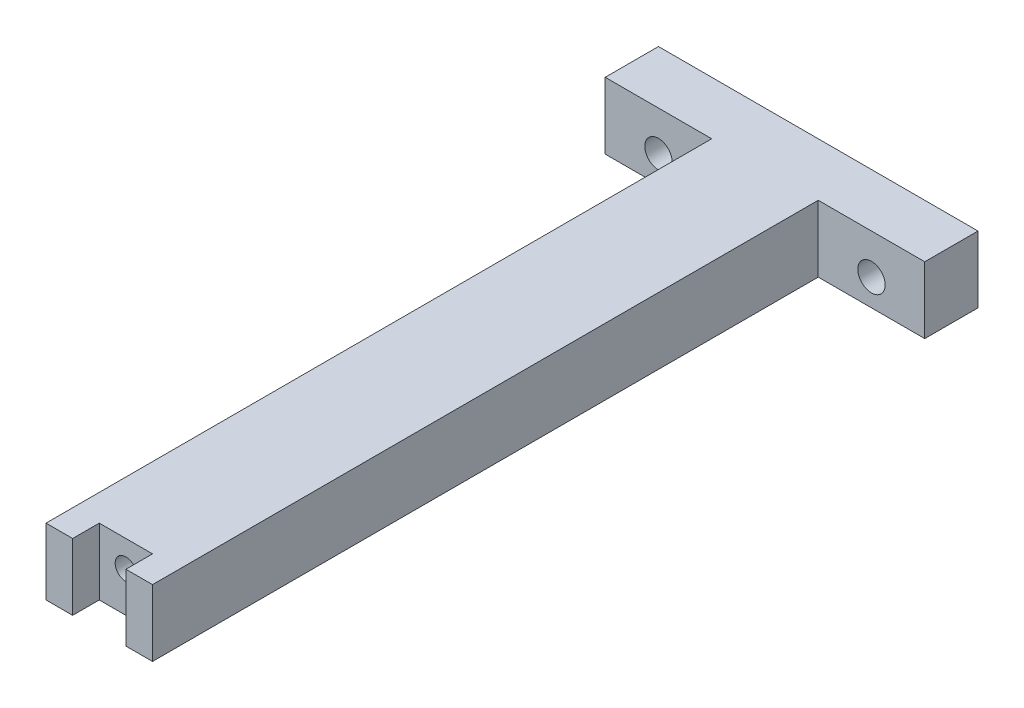
ISO-10303-21;
HEADER;
FILE_DESCRIPTION(('STEP AP214'),'2;1');
FILE_NAME('part.step','',(''),(''),'','','');
FILE_SCHEMA(('AUTOMOTIVE_DESIGN { 1 0 10303 214 1 1 1 1 }'));
ENDSEC;
DATA;
#1=APPLICATION_CONTEXT('core data for automotive mechanical design processes');
#2=APPLICATION_PROTOCOL_DEFINITION('international standard','automotive_design',2000,#1);
#3=PRODUCT_CONTEXT('',#1,'mechanical');
#4=PRODUCT('Part','Part','',(#3));
#5=PRODUCT_RELATED_PRODUCT_CATEGORY('part','',(#4));
#6=PRODUCT_DEFINITION_FORMATION('','',#4);
#7=PRODUCT_DEFINITION_CONTEXT('part definition',#1,'design');
#8=PRODUCT_DEFINITION('design','',#6,#7);
#9=PRODUCT_DEFINITION_SHAPE('','',#8);
#10=(LENGTH_UNIT() NAMED_UNIT(*) SI_UNIT(.MILLI.,.METRE.));
#11=(NAMED_UNIT(*) PLANE_ANGLE_UNIT() SI_UNIT($,.RADIAN.));
#12=(NAMED_UNIT(*) SI_UNIT($,.STERADIAN.) SOLID_ANGLE_UNIT());
#13=UNCERTAINTY_MEASURE_WITH_UNIT(LENGTH_MEASURE(1.E-05),#10,'distance_accuracy_value','');
#14=(GEOMETRIC_REPRESENTATION_CONTEXT(3) GLOBAL_UNCERTAINTY_ASSIGNED_CONTEXT((#13)) GLOBAL_UNIT_ASSIGNED_CONTEXT((#10,
#11,#12)) REPRESENTATION_CONTEXT('',''));
#15=CARTESIAN_POINT('',(0.,0.,0.));
#16=DIRECTION('',(0.,0.,1.));
#17=DIRECTION('',(1.,0.,0.));
#18=AXIS2_PLACEMENT_3D('',#15,#16,#17);
#19=CARTESIAN_POINT('',(0.,0.,171.45));
#20=DIRECTION('',(0.,0.,-1.));
#21=DIRECTION('',(-1.,0.,0.));
#22=AXIS2_PLACEMENT_3D('',#19,#20,#21);
#23=PLANE('',#22);
#24=DIRECTION('',(-1.,0.,0.));
#25=VECTOR('',#24,1.);
#26=CARTESIAN_POINT('',(-38.1,7.9375,171.45));
#27=LINE('',#26,#25);
#28=CARTESIAN_POINT('',(12.7,7.9375,171.45));
#29=VERTEX_POINT('',#28);
#30=CARTESIAN_POINT('',(6.35,7.9375,171.45));
#31=VERTEX_POINT('',#30);
#32=EDGE_CURVE('E206',#29,#31,#27,.T.);
#33=ORIENTED_EDGE('',*,*,#32,.T.);
#34=DIRECTION('',(0.,1.,0.));
#35=VECTOR('',#34,1.);
#36=CARTESIAN_POINT('',(6.35,-7.9375,171.45));
#37=LINE('',#36,#35);
#38=CARTESIAN_POINT('',(6.35,-7.9375,171.45));
#39=VERTEX_POINT('',#38);
#40=EDGE_CURVE('E140',#39,#31,#37,.T.);
#41=ORIENTED_EDGE('',*,*,#40,.F.);
#42=DIRECTION('',(1.,0.,0.));
#43=VECTOR('',#42,1.);
#44=CARTESIAN_POINT('',(-38.1,-7.9375,171.45));
#45=LINE('',#44,#43);
#46=CARTESIAN_POINT('',(12.7,-7.9375,171.45));
#47=VERTEX_POINT('',#46);
#48=EDGE_CURVE('E209',#39,#47,#45,.T.);
#49=ORIENTED_EDGE('',*,*,#48,.T.);
#50=DIRECTION('',(0.,-1.,0.));
#51=VECTOR('',#50,1.);
#52=CARTESIAN_POINT('',(12.7,7.9375,171.45));
#53=LINE('',#52,#51);
#54=EDGE_CURVE('E165',#29,#47,#53,.T.);
#55=ORIENTED_EDGE('',*,*,#54,.F.);
#56=EDGE_LOOP('',(#33,#41,#49,#55));
#57=FACE_BOUND('',#56,.T.);
#58=ADVANCED_FACE('F38',(#57),#23,.F.);
#59=CARTESIAN_POINT('',(-38.1,-7.9375,171.45));
#60=DIRECTION('',(1.,0.,0.));
#61=DIRECTION('',(0.,0.,-1.));
#62=AXIS2_PLACEMENT_3D('',#59,#60,#61);
#63=PLANE('',#62);
#64=DIRECTION('',(0.,-1.,0.));
#65=VECTOR('',#64,1.);
#66=CARTESIAN_POINT('',(-38.1,7.9375,12.7));
#67=LINE('',#66,#65);
#68=CARTESIAN_POINT('',(-38.1,7.9375,12.7));
#69=VERTEX_POINT('',#68);
#70=CARTESIAN_POINT('',(-38.1,-7.9375,12.7));
#71=VERTEX_POINT('',#70);
#72=EDGE_CURVE('E172',#69,#71,#67,.T.);
#73=ORIENTED_EDGE('',*,*,#72,.F.);
#74=DIRECTION('',(0.,0.,-1.));
#75=VECTOR('',#74,1.);
#76=CARTESIAN_POINT('',(-38.1,7.9375,171.45));
#77=LINE('',#76,#75);
#78=CARTESIAN_POINT('',(-38.1,7.9375,0.));
#79=VERTEX_POINT('',#78);
#80=EDGE_CURVE('E47',#69,#79,#77,.T.);
#81=ORIENTED_EDGE('',*,*,#80,.T.);
#82=DIRECTION('',(0.,-1.,0.));
#83=VECTOR('',#82,1.);
#84=CARTESIAN_POINT('',(-38.1,-7.9375,0.));
#85=LINE('',#84,#83);
#86=CARTESIAN_POINT('',(-38.1,-7.9375,0.));
#87=VERTEX_POINT('',#86);
#88=EDGE_CURVE('E220',#79,#87,#85,.T.);
#89=ORIENTED_EDGE('',*,*,#88,.T.);
#90=DIRECTION('',(0.,0.,-1.));
#91=VECTOR('',#90,1.);
#92=CARTESIAN_POINT('',(-38.1,-7.9375,171.45));
#93=LINE('',#92,#91);
#94=EDGE_CURVE('E227',#71,#87,#93,.T.);
#95=ORIENTED_EDGE('',*,*,#94,.F.);
#96=EDGE_LOOP('',(#73,#81,#89,#95));
#97=FACE_BOUND('',#96,.T.);
#98=ADVANCED_FACE('F278',(#97),#63,.F.);
#99=CARTESIAN_POINT('',(38.1,-7.9375,171.45));
#100=DIRECTION('',(-1.,0.,0.));
#101=DIRECTION('',(0.,0.,1.));
#102=AXIS2_PLACEMENT_3D('',#99,#100,#101);
#103=PLANE('',#102);
#104=DIRECTION('',(0.,0.,-1.));
#105=VECTOR('',#104,1.);
#106=CARTESIAN_POINT('',(38.1,7.9375,171.45));
#107=LINE('',#106,#105);
#108=CARTESIAN_POINT('',(38.1,7.9375,12.7));
#109=VERTEX_POINT('',#108);
#110=CARTESIAN_POINT('',(38.1,7.9375,0.));
#111=VERTEX_POINT('',#110);
#112=EDGE_CURVE('E11',#109,#111,#107,.T.);
#113=ORIENTED_EDGE('',*,*,#112,.F.);
#114=DIRECTION('',(0.,1.,0.));
#115=VECTOR('',#114,1.);
#116=CARTESIAN_POINT('',(38.1,7.9375,12.7));
#117=LINE('',#116,#115);
#118=CARTESIAN_POINT('',(38.1,-7.9375,12.7));
#119=VERTEX_POINT('',#118);
#120=EDGE_CURVE('E190',#119,#109,#117,.T.);
#121=ORIENTED_EDGE('',*,*,#120,.F.);
#122=DIRECTION('',(0.,0.,-1.));
#123=VECTOR('',#122,1.);
#124=CARTESIAN_POINT('',(38.1,-7.9375,171.45));
#125=LINE('',#124,#123);
#126=CARTESIAN_POINT('',(38.1,-7.9375,0.));
#127=VERTEX_POINT('',#126);
#128=EDGE_CURVE('E214',#119,#127,#125,.T.);
#129=ORIENTED_EDGE('',*,*,#128,.T.);
#130=DIRECTION('',(0.,1.,0.));
#131=VECTOR('',#130,1.);
#132=CARTESIAN_POINT('',(38.1,-7.9375,0.));
#133=LINE('',#132,#131);
#134=EDGE_CURVE('E188',#127,#111,#133,.T.);
#135=ORIENTED_EDGE('',*,*,#134,.T.);
#136=EDGE_LOOP('',(#113,#121,#129,#135));
#137=FACE_BOUND('',#136,.T.);
#138=ADVANCED_FACE('F40',(#137),#103,.F.);
#139=CARTESIAN_POINT('',(-38.1,7.9375,171.45));
#140=DIRECTION('',(0.,-1.,0.));
#141=DIRECTION('',(0.,0.,-1.));
#142=AXIS2_PLACEMENT_3D('',#139,#140,#141);
#143=PLANE('',#142);
#144=DIRECTION('',(-1.,0.,0.));
#145=VECTOR('',#144,1.);
#146=CARTESIAN_POINT('',(-6.35,7.9375,165.1));
#147=LINE('',#146,#145);
#148=CARTESIAN_POINT('',(6.35,7.9375,165.1));
#149=VERTEX_POINT('',#148);
#150=CARTESIAN_POINT('',(-6.35,7.9375,165.1));
#151=VERTEX_POINT('',#150);
#152=EDGE_CURVE('E152',#149,#151,#147,.T.);
#153=ORIENTED_EDGE('',*,*,#152,.F.);
#154=DIRECTION('',(0.,0.,1.));
#155=VECTOR('',#154,1.);
#156=CARTESIAN_POINT('',(6.35,7.9375,165.1));
#157=LINE('',#156,#155);
#158=EDGE_CURVE('E160',#149,#31,#157,.T.);
#159=ORIENTED_EDGE('',*,*,#158,.T.);
#160=ORIENTED_EDGE('',*,*,#32,.F.);
#161=DIRECTION('',(0.,0.,1.));
#162=VECTOR('',#161,1.);
#163=CARTESIAN_POINT('',(12.7,7.9375,12.7));
#164=LINE('',#163,#162);
#165=CARTESIAN_POINT('',(12.7,7.9375,12.7));
#166=VERTEX_POINT('',#165);
#167=EDGE_CURVE('E200',#166,#29,#164,.T.);
#168=ORIENTED_EDGE('',*,*,#167,.F.);
#169=DIRECTION('',(-1.,0.,0.));
#170=VECTOR('',#169,1.);
#171=CARTESIAN_POINT('',(38.1,7.9375,12.7));
#172=LINE('',#171,#170);
#173=EDGE_CURVE('E192',#109,#166,#172,.T.);
#174=ORIENTED_EDGE('',*,*,#173,.F.);
#175=ORIENTED_EDGE('',*,*,#112,.T.);
#176=DIRECTION('',(-1.,0.,0.));
#177=VECTOR('',#176,1.);
#178=CARTESIAN_POINT('',(-38.1,7.9375,0.));
#179=LINE('',#178,#177);
#180=EDGE_CURVE('E217',#111,#79,#179,.T.);
#181=ORIENTED_EDGE('',*,*,#180,.T.);
#182=ORIENTED_EDGE('',*,*,#80,.F.);
#183=DIRECTION('',(-1.,0.,0.));
#184=VECTOR('',#183,1.);
#185=CARTESIAN_POINT('',(-38.1,7.9375,12.7));
#186=LINE('',#185,#184);
#187=CARTESIAN_POINT('',(-12.7,7.9375,12.7));
#188=VERTEX_POINT('',#187);
#189=EDGE_CURVE('E181',#188,#69,#186,.T.);
#190=ORIENTED_EDGE('',*,*,#189,.F.);
#191=DIRECTION('',(0.,0.,1.));
#192=VECTOR('',#191,1.);
#193=CARTESIAN_POINT('',(-12.7,7.9375,12.7));
#194=LINE('',#193,#192);
#195=CARTESIAN_POINT('',(-12.7,7.9375,171.45));
#196=VERTEX_POINT('',#195);
#197=EDGE_CURVE('E185',#188,#196,#194,.T.);
#198=ORIENTED_EDGE('',*,*,#197,.T.);
#199=CARTESIAN_POINT('',(-6.35000000000001,7.9375,171.45));
#200=VERTEX_POINT('',#199);
#201=EDGE_CURVE('E210',#200,#196,#27,.T.);
#202=ORIENTED_EDGE('',*,*,#201,.F.);
#203=DIRECTION('',(0.,0.,1.));
#204=VECTOR('',#203,1.);
#205=CARTESIAN_POINT('',(-6.35,7.9375,165.1));
#206=LINE('',#205,#204);
#207=EDGE_CURVE('E55',#151,#200,#206,.T.);
#208=ORIENTED_EDGE('',*,*,#207,.F.);
#209=EDGE_LOOP('',(#153,#159,#160,#168,#174,#175,#181,#182,#190,#198,#202,#208));
#210=FACE_BOUND('',#209,.T.);
#211=ADVANCED_FACE('F268',(#210),#143,.F.);
#212=CARTESIAN_POINT('',(-38.1,-7.9375,171.45));
#213=DIRECTION('',(0.,1.,0.));
#214=DIRECTION('',(0.,0.,1.));
#215=AXIS2_PLACEMENT_3D('',#212,#213,#214);
#216=PLANE('',#215);
#217=ORIENTED_EDGE('',*,*,#48,.F.);
#218=DIRECTION('',(0.,0.,1.));
#219=VECTOR('',#218,1.);
#220=CARTESIAN_POINT('',(6.35,-7.9375,165.1));
#221=LINE('',#220,#219);
#222=CARTESIAN_POINT('',(6.35,-7.9375,165.1));
#223=VERTEX_POINT('',#222);
#224=EDGE_CURVE('E163',#223,#39,#221,.T.);
#225=ORIENTED_EDGE('',*,*,#224,.F.);
#226=DIRECTION('',(1.,0.,0.));
#227=VECTOR('',#226,1.);
#228=CARTESIAN_POINT('',(-6.35,-7.9375,165.1));
#229=LINE('',#228,#227);
#230=CARTESIAN_POINT('',(-6.35,-7.9375,165.1));
#231=VERTEX_POINT('',#230);
#232=EDGE_CURVE('E158',#231,#223,#229,.T.);
#233=ORIENTED_EDGE('',*,*,#232,.F.);
#234=DIRECTION('',(0.,0.,1.));
#235=VECTOR('',#234,1.);
#236=CARTESIAN_POINT('',(-6.35,-7.9375,165.1));
#237=LINE('',#236,#235);
#238=CARTESIAN_POINT('',(-6.35,-7.9375,171.45));
#239=VERTEX_POINT('',#238);
#240=EDGE_CURVE('E166',#231,#239,#237,.T.);
#241=ORIENTED_EDGE('',*,*,#240,.T.);
#242=CARTESIAN_POINT('',(-12.7,-7.9375,171.45));
#243=VERTEX_POINT('',#242);
#244=EDGE_CURVE('E211',#243,#239,#45,.T.);
#245=ORIENTED_EDGE('',*,*,#244,.F.);
#246=DIRECTION('',(0.,0.,1.));
#247=VECTOR('',#246,1.);
#248=CARTESIAN_POINT('',(-12.7,-7.9375,12.7));
#249=LINE('',#248,#247);
#250=CARTESIAN_POINT('',(-12.7,-7.9375,12.7));
#251=VERTEX_POINT('',#250);
#252=EDGE_CURVE('E63',#251,#243,#249,.T.);
#253=ORIENTED_EDGE('',*,*,#252,.F.);
#254=DIRECTION('',(1.,0.,0.));
#255=VECTOR('',#254,1.);
#256=CARTESIAN_POINT('',(-38.1,-7.9375,12.7));
#257=LINE('',#256,#255);
#258=EDGE_CURVE('E174',#71,#251,#257,.T.);
#259=ORIENTED_EDGE('',*,*,#258,.F.);
#260=ORIENTED_EDGE('',*,*,#94,.T.);
#261=DIRECTION('',(1.,0.,0.));
#262=VECTOR('',#261,1.);
#263=CARTESIAN_POINT('',(-38.1,-7.9375,0.));
#264=LINE('',#263,#262);
#265=EDGE_CURVE('E223',#87,#127,#264,.T.);
#266=ORIENTED_EDGE('',*,*,#265,.T.);
#267=ORIENTED_EDGE('',*,*,#128,.F.);
#268=DIRECTION('',(1.,0.,0.));
#269=VECTOR('',#268,1.);
#270=CARTESIAN_POINT('',(38.1,-7.9375,12.7));
#271=LINE('',#270,#269);
#272=CARTESIAN_POINT('',(12.7,-7.9375,12.7));
#273=VERTEX_POINT('',#272);
#274=EDGE_CURVE('E198',#273,#119,#271,.T.);
#275=ORIENTED_EDGE('',*,*,#274,.F.);
#276=DIRECTION('',(0.,0.,1.));
#277=VECTOR('',#276,1.);
#278=CARTESIAN_POINT('',(12.7,-7.9375,12.7));
#279=LINE('',#278,#277);
#280=EDGE_CURVE('E184',#273,#47,#279,.T.);
#281=ORIENTED_EDGE('',*,*,#280,.T.);
#282=EDGE_LOOP('',(#217,#225,#233,#241,#245,#253,#259,#260,#266,#267,#275,#281));
#283=FACE_BOUND('',#282,.T.);
#284=ADVANCED_FACE('F285',(#283),#216,.F.);
#285=ORIENTED_EDGE('',*,*,#244,.T.);
#286=DIRECTION('',(0.,-1.,0.));
#287=VECTOR('',#286,1.);
#288=CARTESIAN_POINT('',(-6.35,-7.9375,171.45));
#289=LINE('',#288,#287);
#290=EDGE_CURVE('E143',#200,#239,#289,.T.);
#291=ORIENTED_EDGE('',*,*,#290,.F.);
#292=ORIENTED_EDGE('',*,*,#201,.T.);
#293=DIRECTION('',(0.,1.,0.));
#294=VECTOR('',#293,1.);
#295=CARTESIAN_POINT('',(-12.7,7.9375,171.45));
#296=LINE('',#295,#294);
#297=EDGE_CURVE('E175',#243,#196,#296,.T.);
#298=ORIENTED_EDGE('',*,*,#297,.F.);
#299=EDGE_LOOP('',(#285,#291,#292,#298));
#300=FACE_BOUND('',#299,.T.);
#301=ADVANCED_FACE('F289',(#300),#23,.F.);
#302=CARTESIAN_POINT('',(0.,0.,0.));
#303=DIRECTION('',(0.,0.,-1.));
#304=DIRECTION('',(-1.,0.,0.));
#305=AXIS2_PLACEMENT_3D('',#302,#303,#304);
#306=PLANE('',#305);
#307=CARTESIAN_POINT('',(-25.4,-1.5875,0.));
#308=DIRECTION('',(0.,0.,1.));
#309=DIRECTION('',(1.,0.,0.));
#310=AXIS2_PLACEMENT_3D('',#307,#308,#309);
#311=CIRCLE('',#310,3.2639);
#312=CARTESIAN_POINT('',(-22.1361,-1.5875,0.));
#313=VERTEX_POINT('',#312);
#314=EDGE_CURVE('E231',#313,#313,#311,.T.);
#315=ORIENTED_EDGE('',*,*,#314,.T.);
#316=EDGE_LOOP('',(#315));
#317=FACE_BOUND('',#316,.T.);
#318=CARTESIAN_POINT('',(25.4,-1.5875,0.));
#319=DIRECTION('',(0.,0.,1.));
#320=DIRECTION('',(1.,0.,0.));
#321=AXIS2_PLACEMENT_3D('',#318,#319,#320);
#322=CIRCLE('',#321,3.2639);
#323=CARTESIAN_POINT('',(28.6639,-1.5875,0.));
#324=VERTEX_POINT('',#323);
#325=EDGE_CURVE('E236',#324,#324,#322,.T.);
#326=ORIENTED_EDGE('',*,*,#325,.T.);
#327=EDGE_LOOP('',(#326));
#328=FACE_BOUND('',#327,.T.);
#329=ORIENTED_EDGE('',*,*,#134,.F.);
#330=ORIENTED_EDGE('',*,*,#265,.F.);
#331=ORIENTED_EDGE('',*,*,#88,.F.);
#332=ORIENTED_EDGE('',*,*,#180,.F.);
#333=EDGE_LOOP('',(#329,#330,#331,#332));
#334=FACE_BOUND('',#333,.T.);
#335=ADVANCED_FACE('F243',(#317,#328,#334),#306,.T.);
#336=CARTESIAN_POINT('',(12.7,7.9375,12.7));
#337=DIRECTION('',(-1.,0.,0.));
#338=DIRECTION('',(0.,-1.,0.));
#339=AXIS2_PLACEMENT_3D('',#336,#337,#338);
#340=PLANE('',#339);
#341=ORIENTED_EDGE('',*,*,#54,.T.);
#342=ORIENTED_EDGE('',*,*,#280,.F.);
#343=DIRECTION('',(0.,-1.,0.));
#344=VECTOR('',#343,1.);
#345=CARTESIAN_POINT('',(12.7,7.9375,12.7));
#346=LINE('',#345,#344);
#347=EDGE_CURVE('E195',#166,#273,#346,.T.);
#348=ORIENTED_EDGE('',*,*,#347,.F.);
#349=ORIENTED_EDGE('',*,*,#167,.T.);
#350=EDGE_LOOP('',(#341,#342,#348,#349));
#351=FACE_BOUND('',#350,.T.);
#352=ADVANCED_FACE('F257',(#351),#340,.F.);
#353=CARTESIAN_POINT('',(0.,0.,12.7));
#354=DIRECTION('',(0.,0.,-1.));
#355=DIRECTION('',(-1.,0.,0.));
#356=AXIS2_PLACEMENT_3D('',#353,#354,#355);
#357=PLANE('',#356);
#358=CARTESIAN_POINT('',(25.4,-1.5875,12.7));
#359=DIRECTION('',(0.,0.,-1.));
#360=DIRECTION('',(-1.,0.,0.));
#361=AXIS2_PLACEMENT_3D('',#358,#359,#360);
#362=CIRCLE('',#361,3.2639);
#363=CARTESIAN_POINT('',(22.1361,-1.5875,12.7));
#364=VERTEX_POINT('',#363);
#365=EDGE_CURVE('E42',#364,#364,#362,.T.);
#366=ORIENTED_EDGE('',*,*,#365,.T.);
#367=EDGE_LOOP('',(#366));
#368=FACE_BOUND('',#367,.T.);
#369=ORIENTED_EDGE('',*,*,#120,.T.);
#370=ORIENTED_EDGE('',*,*,#173,.T.);
#371=ORIENTED_EDGE('',*,*,#347,.T.);
#372=ORIENTED_EDGE('',*,*,#274,.T.);
#373=EDGE_LOOP('',(#369,#370,#371,#372));
#374=FACE_BOUND('',#373,.T.);
#375=ADVANCED_FACE('F253',(#368,#374),#357,.F.);
#376=CARTESIAN_POINT('',(-12.7,7.9375,12.7));
#377=DIRECTION('',(1.,0.,0.));
#378=DIRECTION('',(0.,1.,0.));
#379=AXIS2_PLACEMENT_3D('',#376,#377,#378);
#380=PLANE('',#379);
#381=ORIENTED_EDGE('',*,*,#297,.T.);
#382=ORIENTED_EDGE('',*,*,#197,.F.);
#383=DIRECTION('',(0.,1.,0.));
#384=VECTOR('',#383,1.);
#385=CARTESIAN_POINT('',(-12.7,7.9375,12.7));
#386=LINE('',#385,#384);
#387=EDGE_CURVE('E178',#251,#188,#386,.T.);
#388=ORIENTED_EDGE('',*,*,#387,.F.);
#389=ORIENTED_EDGE('',*,*,#252,.T.);
#390=EDGE_LOOP('',(#381,#382,#388,#389));
#391=FACE_BOUND('',#390,.T.);
#392=ADVANCED_FACE('F256',(#391),#380,.F.);
#393=CARTESIAN_POINT('',(0.,0.,12.7));
#394=DIRECTION('',(0.,0.,1.));
#395=DIRECTION('',(1.,0.,0.));
#396=AXIS2_PLACEMENT_3D('',#393,#394,#395);
#397=PLANE('',#396);
#398=CARTESIAN_POINT('',(-25.4,-1.5875,12.7));
#399=DIRECTION('',(0.,0.,1.));
#400=DIRECTION('',(1.,0.,0.));
#401=AXIS2_PLACEMENT_3D('',#398,#399,#400);
#402=CIRCLE('',#401,3.2639);
#403=CARTESIAN_POINT('',(-22.1361,-1.5875,12.7));
#404=VERTEX_POINT('',#403);
#405=EDGE_CURVE('E229',#404,#404,#402,.T.);
#406=ORIENTED_EDGE('',*,*,#405,.F.);
#407=EDGE_LOOP('',(#406));
#408=FACE_BOUND('',#407,.T.);
#409=ORIENTED_EDGE('',*,*,#72,.T.);
#410=ORIENTED_EDGE('',*,*,#258,.T.);
#411=ORIENTED_EDGE('',*,*,#387,.T.);
#412=ORIENTED_EDGE('',*,*,#189,.T.);
#413=EDGE_LOOP('',(#409,#410,#411,#412));
#414=FACE_BOUND('',#413,.T.);
#415=ADVANCED_FACE('F282',(#408,#414),#397,.T.);
#416=CARTESIAN_POINT('',(6.35,-7.9375,165.1));
#417=DIRECTION('',(1.,0.,0.));
#418=DIRECTION('',(0.,0.,-1.));
#419=AXIS2_PLACEMENT_3D('',#416,#417,#418);
#420=PLANE('',#419);
#421=ORIENTED_EDGE('',*,*,#40,.T.);
#422=ORIENTED_EDGE('',*,*,#158,.F.);
#423=DIRECTION('',(0.,1.,0.));
#424=VECTOR('',#423,1.);
#425=CARTESIAN_POINT('',(6.35,-7.9375,165.1));
#426=LINE('',#425,#424);
#427=EDGE_CURVE('E149',#223,#149,#426,.T.);
#428=ORIENTED_EDGE('',*,*,#427,.F.);
#429=ORIENTED_EDGE('',*,*,#224,.T.);
#430=EDGE_LOOP('',(#421,#422,#428,#429));
#431=FACE_BOUND('',#430,.T.);
#432=ADVANCED_FACE('F294',(#431),#420,.F.);
#433=CARTESIAN_POINT('',(-6.35,-7.9375,165.1));
#434=DIRECTION('',(-1.,0.,0.));
#435=DIRECTION('',(0.,0.,1.));
#436=AXIS2_PLACEMENT_3D('',#433,#434,#435);
#437=PLANE('',#436);
#438=ORIENTED_EDGE('',*,*,#290,.T.);
#439=ORIENTED_EDGE('',*,*,#240,.F.);
#440=DIRECTION('',(0.,-1.,0.));
#441=VECTOR('',#440,1.);
#442=CARTESIAN_POINT('',(-6.35,-7.9375,165.1));
#443=LINE('',#442,#441);
#444=EDGE_CURVE('E155',#151,#231,#443,.T.);
#445=ORIENTED_EDGE('',*,*,#444,.F.);
#446=ORIENTED_EDGE('',*,*,#207,.T.);
#447=EDGE_LOOP('',(#438,#439,#445,#446));
#448=FACE_BOUND('',#447,.T.);
#449=ADVANCED_FACE('F372',(#448),#437,.F.);
#450=CARTESIAN_POINT('',(0.,0.,165.1));
#451=DIRECTION('',(0.,0.,-1.));
#452=DIRECTION('',(-1.,0.,0.));
#453=AXIS2_PLACEMENT_3D('',#450,#451,#452);
#454=PLANE('',#453);
#455=CARTESIAN_POINT('',(0.,1.5875,165.1));
#456=DIRECTION('',(0.,0.,1.));
#457=DIRECTION('',(1.,0.,0.));
#458=AXIS2_PLACEMENT_3D('',#455,#456,#457);
#459=CIRCLE('',#458,2.55269999999999);
#460=CARTESIAN_POINT('',(2.55269999999999,1.5875,165.1));
#461=VERTEX_POINT('',#460);
#462=EDGE_CURVE('E141',#461,#461,#459,.T.);
#463=ORIENTED_EDGE('',*,*,#462,.F.);
#464=EDGE_LOOP('',(#463));
#465=FACE_BOUND('',#464,.T.);
#466=ORIENTED_EDGE('',*,*,#427,.T.);
#467=ORIENTED_EDGE('',*,*,#152,.T.);
#468=ORIENTED_EDGE('',*,*,#444,.T.);
#469=ORIENTED_EDGE('',*,*,#232,.T.);
#470=EDGE_LOOP('',(#466,#467,#468,#469));
#471=FACE_BOUND('',#470,.T.);
#472=ADVANCED_FACE('F134',(#465,#471),#454,.F.);
#473=CARTESIAN_POINT('',(0.,1.5875,154.2796));
#474=DIRECTION('',(0.,0.,1.));
#475=DIRECTION('',(1.,0.,0.));
#476=AXIS2_PLACEMENT_3D('',#473,#474,#475);
#477=CONICAL_SURFACE('',#476,2.55269999999999,1.02974425867665);
#478=CARTESIAN_POINT('',(0.,1.5875,152.745783097808));
#479=VERTEX_POINT('',#478);
#480=VERTEX_LOOP('',#479);
#481=FACE_BOUND('',#480,.T.);
#482=CARTESIAN_POINT('',(0.,1.5875,154.2796));
#483=DIRECTION('',(0.,0.,1.));
#484=DIRECTION('',(1.,0.,0.));
#485=AXIS2_PLACEMENT_3D('',#482,#483,#484);
#486=CIRCLE('',#485,2.55269999999999);
#487=CARTESIAN_POINT('',(2.55269999999999,1.5875,154.2796));
#488=VERTEX_POINT('',#487);
#489=EDGE_CURVE('E138',#488,#488,#486,.T.);
#490=ORIENTED_EDGE('',*,*,#489,.T.);
#491=EDGE_LOOP('',(#490));
#492=FACE_BOUND('',#491,.T.);
#493=ADVANCED_FACE('F130',(#481,#492),#477,.F.);
#494=CARTESIAN_POINT('',(0.,1.5875,165.1));
#495=DIRECTION('',(0.,0.,1.));
#496=DIRECTION('',(1.,0.,0.));
#497=AXIS2_PLACEMENT_3D('',#494,#495,#496);
#498=CYLINDRICAL_SURFACE('',#497,2.55269999999999);
#499=ORIENTED_EDGE('',*,*,#489,.F.);
#500=EDGE_LOOP('',(#499));
#501=FACE_BOUND('',#500,.T.);
#502=ORIENTED_EDGE('',*,*,#462,.T.);
#503=EDGE_LOOP('',(#502));
#504=FACE_BOUND('',#503,.T.);
#505=ADVANCED_FACE('F133',(#501,#504),#498,.F.);
#506=CARTESIAN_POINT('',(-25.4,-1.5875,0.));
#507=DIRECTION('',(0.,0.,1.));
#508=DIRECTION('',(1.,0.,0.));
#509=AXIS2_PLACEMENT_3D('',#506,#507,#508);
#510=CYLINDRICAL_SURFACE('',#509,3.2639);
#511=ORIENTED_EDGE('',*,*,#405,.T.);
#512=EDGE_LOOP('',(#511));
#513=FACE_BOUND('',#512,.T.);
#514=ORIENTED_EDGE('',*,*,#314,.F.);
#515=EDGE_LOOP('',(#514));
#516=FACE_BOUND('',#515,.T.);
#517=ADVANCED_FACE('F249',(#513,#516),#510,.F.);
#518=CARTESIAN_POINT('',(25.4,-1.5875,0.));
#519=DIRECTION('',(0.,0.,1.));
#520=DIRECTION('',(1.,0.,0.));
#521=AXIS2_PLACEMENT_3D('',#518,#519,#520);
#522=CYLINDRICAL_SURFACE('',#521,3.2639);
#523=ORIENTED_EDGE('',*,*,#325,.F.);
#524=EDGE_LOOP('',(#523));
#525=FACE_BOUND('',#524,.T.);
#526=ORIENTED_EDGE('',*,*,#365,.F.);
#527=EDGE_LOOP('',(#526));
#528=FACE_BOUND('',#527,.T.);
#529=ADVANCED_FACE('F246',(#525,#528),#522,.F.);
#530=CLOSED_SHELL('',(#58,#98,#138,#211,#284,#301,#335,#352,#375,#392,#415,#432,#449,#472,#493,
#505,#517,#529));
#531=MANIFOLD_SOLID_BREP('B2',#530);
#532=ADVANCED_BREP_SHAPE_REPRESENTATION('',(#18,#531),#14);
#533=SHAPE_DEFINITION_REPRESENTATION(#9,#532);
ENDSEC;
END-ISO-10303-21;
